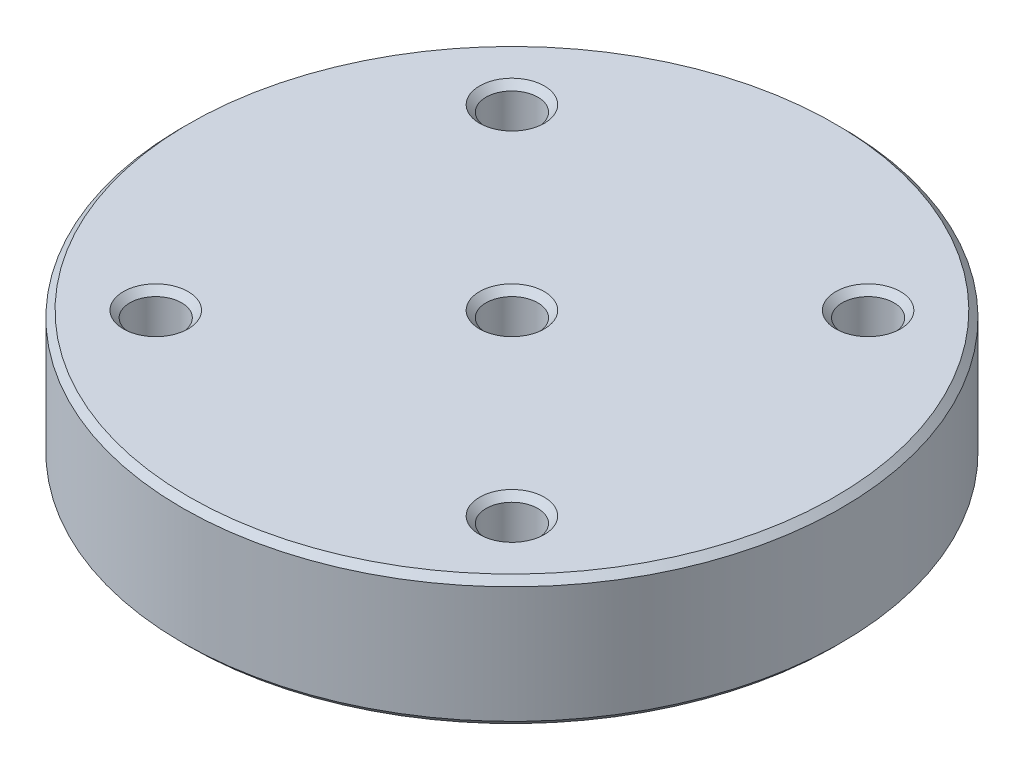
ISO-10303-21;
HEADER;
FILE_DESCRIPTION(('STEP AP214'),'2;1');
FILE_NAME('part.step','',(''),(''),'','','');
FILE_SCHEMA(('AUTOMOTIVE_DESIGN { 1 0 10303 214 1 1 1 1 }'));
ENDSEC;
DATA;
#1=APPLICATION_CONTEXT('core data for automotive mechanical design processes');
#2=APPLICATION_PROTOCOL_DEFINITION('international standard','automotive_design',2000,#1);
#3=PRODUCT_CONTEXT('',#1,'mechanical');
#4=PRODUCT('Part','Part','',(#3));
#5=PRODUCT_RELATED_PRODUCT_CATEGORY('part','',(#4));
#6=PRODUCT_DEFINITION_FORMATION('','',#4);
#7=PRODUCT_DEFINITION_CONTEXT('part definition',#1,'design');
#8=PRODUCT_DEFINITION('design','',#6,#7);
#9=PRODUCT_DEFINITION_SHAPE('','',#8);
#10=(LENGTH_UNIT() NAMED_UNIT(*) SI_UNIT(.MILLI.,.METRE.));
#11=(NAMED_UNIT(*) PLANE_ANGLE_UNIT() SI_UNIT($,.RADIAN.));
#12=(NAMED_UNIT(*) SI_UNIT($,.STERADIAN.) SOLID_ANGLE_UNIT());
#13=UNCERTAINTY_MEASURE_WITH_UNIT(LENGTH_MEASURE(1.E-05),#10,'distance_accuracy_value','');
#14=(GEOMETRIC_REPRESENTATION_CONTEXT(3) GLOBAL_UNCERTAINTY_ASSIGNED_CONTEXT((#13)) GLOBAL_UNIT_ASSIGNED_CONTEXT((#10,
#11,#12)) REPRESENTATION_CONTEXT('',''));
#15=CARTESIAN_POINT('',(0.,0.,0.));
#16=DIRECTION('',(0.,0.,1.));
#17=DIRECTION('',(1.,0.,0.));
#18=AXIS2_PLACEMENT_3D('',#15,#16,#17);
#19=CARTESIAN_POINT('',(0.,8.,0.));
#20=DIRECTION('',(0.,1.,0.));
#21=DIRECTION('',(0.,0.,1.));
#22=AXIS2_PLACEMENT_3D('',#19,#20,#21);
#23=PLANE('',#22);
#24=CARTESIAN_POINT('',(-11.,8.,11.));
#25=DIRECTION('',(0.,1.,0.));
#26=DIRECTION('',(0.,0.,1.));
#27=AXIS2_PLACEMENT_3D('',#24,#25,#26);
#28=CIRCLE('',#27,1.99999999999999);
#29=CARTESIAN_POINT('',(-11.,8.,13.));
#30=VERTEX_POINT('',#29);
#31=EDGE_CURVE('E10',#30,#30,#28,.F.);
#32=ORIENTED_EDGE('',*,*,#31,.T.);
#33=EDGE_LOOP('',(#32));
#34=FACE_BOUND('',#33,.T.);
#35=CARTESIAN_POINT('',(11.,8.,-11.));
#36=DIRECTION('',(0.,1.,0.));
#37=DIRECTION('',(0.,0.,1.));
#38=AXIS2_PLACEMENT_3D('',#35,#36,#37);
#39=CIRCLE('',#38,1.99999999999999);
#40=CARTESIAN_POINT('',(11.,8.,-9.00000000000001));
#41=VERTEX_POINT('',#40);
#42=EDGE_CURVE('E56',#41,#41,#39,.F.);
#43=ORIENTED_EDGE('',*,*,#42,.T.);
#44=EDGE_LOOP('',(#43));
#45=FACE_BOUND('',#44,.T.);
#46=CARTESIAN_POINT('',(0.,8.,0.));
#47=DIRECTION('',(0.,1.,0.));
#48=DIRECTION('',(0.,0.,1.));
#49=AXIS2_PLACEMENT_3D('',#46,#47,#48);
#50=CIRCLE('',#49,1.99999999999999);
#51=CARTESIAN_POINT('',(0.,8.,1.99999999999999));
#52=VERTEX_POINT('',#51);
#53=EDGE_CURVE('E61',#52,#52,#50,.F.);
#54=ORIENTED_EDGE('',*,*,#53,.T.);
#55=EDGE_LOOP('',(#54));
#56=FACE_BOUND('',#55,.T.);
#57=CARTESIAN_POINT('',(0.,8.,0.));
#58=DIRECTION('',(0.,1.,0.));
#59=DIRECTION('',(0.,0.,1.));
#60=AXIS2_PLACEMENT_3D('',#57,#58,#59);
#61=CIRCLE('',#60,19.9563491861041);
#62=CARTESIAN_POINT('',(0.,8.,19.9563491861041));
#63=VERTEX_POINT('',#62);
#64=EDGE_CURVE('E66',#63,#63,#61,.T.);
#65=ORIENTED_EDGE('',*,*,#64,.T.);
#66=EDGE_LOOP('',(#65));
#67=FACE_BOUND('',#66,.T.);
#68=CARTESIAN_POINT('',(-11.,8.,-11.));
#69=DIRECTION('',(0.,1.,0.));
#70=DIRECTION('',(0.,0.,1.));
#71=AXIS2_PLACEMENT_3D('',#68,#69,#70);
#72=CIRCLE('',#71,2.);
#73=CARTESIAN_POINT('',(-11.,8.,-9.));
#74=VERTEX_POINT('',#73);
#75=EDGE_CURVE('E72',#74,#74,#72,.F.);
#76=ORIENTED_EDGE('',*,*,#75,.T.);
#77=EDGE_LOOP('',(#76));
#78=FACE_BOUND('',#77,.T.);
#79=CARTESIAN_POINT('',(11.,8.,11.));
#80=DIRECTION('',(0.,1.,0.));
#81=DIRECTION('',(0.,0.,1.));
#82=AXIS2_PLACEMENT_3D('',#79,#80,#81);
#83=CIRCLE('',#82,1.99999999999999);
#84=CARTESIAN_POINT('',(11.,8.,13.));
#85=VERTEX_POINT('',#84);
#86=EDGE_CURVE('E76',#85,#85,#83,.F.);
#87=ORIENTED_EDGE('',*,*,#86,.T.);
#88=EDGE_LOOP('',(#87));
#89=FACE_BOUND('',#88,.T.);
#90=ADVANCED_FACE('F47',(#34,#45,#56,#67,#78,#89),#23,.T.);
#91=CARTESIAN_POINT('',(0.,0.,0.));
#92=DIRECTION('',(0.,1.,0.));
#93=DIRECTION('',(0.,0.,1.));
#94=AXIS2_PLACEMENT_3D('',#91,#92,#93);
#95=PLANE('',#94);
#96=CARTESIAN_POINT('',(-11.,0.,11.));
#97=DIRECTION('',(0.,1.,0.));
#98=DIRECTION('',(0.,0.,1.));
#99=AXIS2_PLACEMENT_3D('',#96,#97,#98);
#100=CIRCLE('',#99,1.99999999999999);
#101=CARTESIAN_POINT('',(-11.,0.,13.));
#102=VERTEX_POINT('',#101);
#103=EDGE_CURVE('E128',#102,#102,#100,.T.);
#104=ORIENTED_EDGE('',*,*,#103,.T.);
#105=EDGE_LOOP('',(#104));
#106=FACE_BOUND('',#105,.T.);
#107=CARTESIAN_POINT('',(11.,0.,11.));
#108=DIRECTION('',(0.,1.,0.));
#109=DIRECTION('',(0.,0.,1.));
#110=AXIS2_PLACEMENT_3D('',#107,#108,#109);
#111=CIRCLE('',#110,2.);
#112=CARTESIAN_POINT('',(11.,0.,13.));
#113=VERTEX_POINT('',#112);
#114=EDGE_CURVE('E132',#113,#113,#111,.T.);
#115=ORIENTED_EDGE('',*,*,#114,.T.);
#116=EDGE_LOOP('',(#115));
#117=FACE_BOUND('',#116,.T.);
#118=CARTESIAN_POINT('',(11.,0.,-11.));
#119=DIRECTION('',(0.,1.,0.));
#120=DIRECTION('',(0.,0.,1.));
#121=AXIS2_PLACEMENT_3D('',#118,#119,#120);
#122=CIRCLE('',#121,2.);
#123=CARTESIAN_POINT('',(11.,0.,-9.));
#124=VERTEX_POINT('',#123);
#125=EDGE_CURVE('E136',#124,#124,#122,.T.);
#126=ORIENTED_EDGE('',*,*,#125,.T.);
#127=EDGE_LOOP('',(#126));
#128=FACE_BOUND('',#127,.T.);
#129=CARTESIAN_POINT('',(-11.,0.,-11.));
#130=DIRECTION('',(0.,1.,0.));
#131=DIRECTION('',(0.,0.,1.));
#132=AXIS2_PLACEMENT_3D('',#129,#130,#131);
#133=CIRCLE('',#132,2.);
#134=CARTESIAN_POINT('',(-11.,0.,-9.));
#135=VERTEX_POINT('',#134);
#136=EDGE_CURVE('E140',#135,#135,#133,.T.);
#137=ORIENTED_EDGE('',*,*,#136,.T.);
#138=EDGE_LOOP('',(#137));
#139=FACE_BOUND('',#138,.T.);
#140=CARTESIAN_POINT('',(0.,0.,0.));
#141=DIRECTION('',(0.,1.,0.));
#142=DIRECTION('',(0.,0.,1.));
#143=AXIS2_PLACEMENT_3D('',#140,#141,#142);
#144=CIRCLE('',#143,1.99999999999999);
#145=CARTESIAN_POINT('',(0.,0.,1.99999999999999));
#146=VERTEX_POINT('',#145);
#147=EDGE_CURVE('E144',#146,#146,#144,.T.);
#148=ORIENTED_EDGE('',*,*,#147,.T.);
#149=EDGE_LOOP('',(#148));
#150=FACE_BOUND('',#149,.T.);
#151=CARTESIAN_POINT('',(0.,0.,0.));
#152=DIRECTION('',(0.,1.,0.));
#153=DIRECTION('',(0.,0.,1.));
#154=AXIS2_PLACEMENT_3D('',#151,#152,#153);
#155=CIRCLE('',#154,19.956349186104);
#156=CARTESIAN_POINT('',(0.,0.,19.956349186104));
#157=VERTEX_POINT('',#156);
#158=EDGE_CURVE('E148',#157,#157,#155,.F.);
#159=ORIENTED_EDGE('',*,*,#158,.T.);
#160=EDGE_LOOP('',(#159));
#161=FACE_BOUND('',#160,.T.);
#162=ADVANCED_FACE('F153',(#106,#117,#128,#139,#150,#161),#95,.F.);
#163=CARTESIAN_POINT('',(0.,8.,0.));
#164=DIRECTION('',(0.,-1.,0.));
#165=DIRECTION('',(0.,0.,-1.));
#166=AXIS2_PLACEMENT_3D('',#163,#164,#165);
#167=CYLINDRICAL_SURFACE('',#166,20.356349186104);
#168=CARTESIAN_POINT('',(0.,0.399999999999991,0.));
#169=DIRECTION('',(0.,1.,0.));
#170=DIRECTION('',(0.,0.,1.));
#171=AXIS2_PLACEMENT_3D('',#168,#169,#170);
#172=CIRCLE('',#171,20.356349186104);
#173=CARTESIAN_POINT('',(0.,0.399999999999991,20.356349186104));
#174=VERTEX_POINT('',#173);
#175=EDGE_CURVE('E80',#174,#174,#172,.T.);
#176=ORIENTED_EDGE('',*,*,#175,.T.);
#177=EDGE_LOOP('',(#176));
#178=FACE_BOUND('',#177,.T.);
#179=CARTESIAN_POINT('',(0.,7.60000000000001,0.));
#180=DIRECTION('',(0.,1.,0.));
#181=DIRECTION('',(0.,0.,1.));
#182=AXIS2_PLACEMENT_3D('',#179,#180,#181);
#183=CIRCLE('',#182,20.356349186104);
#184=CARTESIAN_POINT('',(0.,7.60000000000001,20.356349186104));
#185=VERTEX_POINT('',#184);
#186=EDGE_CURVE('E84',#185,#185,#183,.F.);
#187=ORIENTED_EDGE('',*,*,#186,.T.);
#188=EDGE_LOOP('',(#187));
#189=FACE_BOUND('',#188,.T.);
#190=ADVANCED_FACE('F163',(#178,#189),#167,.T.);
#191=CARTESIAN_POINT('',(0.,8.,0.));
#192=DIRECTION('',(0.,-1.,0.));
#193=DIRECTION('',(0.,0.,-1.));
#194=AXIS2_PLACEMENT_3D('',#191,#192,#193);
#195=CYLINDRICAL_SURFACE('',#194,1.6);
#196=CARTESIAN_POINT('',(0.,0.399999999999997,0.));
#197=DIRECTION('',(0.,1.,0.));
#198=DIRECTION('',(0.,0.,1.));
#199=AXIS2_PLACEMENT_3D('',#196,#197,#198);
#200=CIRCLE('',#199,1.6);
#201=CARTESIAN_POINT('',(0.,0.399999999999997,1.6));
#202=VERTEX_POINT('',#201);
#203=EDGE_CURVE('E88',#202,#202,#200,.F.);
#204=ORIENTED_EDGE('',*,*,#203,.T.);
#205=EDGE_LOOP('',(#204));
#206=FACE_BOUND('',#205,.T.);
#207=CARTESIAN_POINT('',(0.,7.6,0.));
#208=DIRECTION('',(0.,1.,0.));
#209=DIRECTION('',(0.,0.,1.));
#210=AXIS2_PLACEMENT_3D('',#207,#208,#209);
#211=CIRCLE('',#210,1.6);
#212=CARTESIAN_POINT('',(0.,7.6,1.6));
#213=VERTEX_POINT('',#212);
#214=EDGE_CURVE('E92',#213,#213,#211,.T.);
#215=ORIENTED_EDGE('',*,*,#214,.T.);
#216=EDGE_LOOP('',(#215));
#217=FACE_BOUND('',#216,.T.);
#218=ADVANCED_FACE('F166',(#206,#217),#195,.F.);
#219=CARTESIAN_POINT('',(-11.,8.,-11.));
#220=DIRECTION('',(0.,-1.,0.));
#221=DIRECTION('',(0.,0.,-1.));
#222=AXIS2_PLACEMENT_3D('',#219,#220,#221);
#223=CYLINDRICAL_SURFACE('',#222,1.6);
#224=CARTESIAN_POINT('',(-11.,0.399999999999998,-11.));
#225=DIRECTION('',(0.,1.,0.));
#226=DIRECTION('',(0.,0.,1.));
#227=AXIS2_PLACEMENT_3D('',#224,#225,#226);
#228=CIRCLE('',#227,1.6);
#229=CARTESIAN_POINT('',(-11.,0.399999999999998,-9.4));
#230=VERTEX_POINT('',#229);
#231=EDGE_CURVE('E96',#230,#230,#228,.F.);
#232=ORIENTED_EDGE('',*,*,#231,.T.);
#233=EDGE_LOOP('',(#232));
#234=FACE_BOUND('',#233,.T.);
#235=CARTESIAN_POINT('',(-11.,7.6,-11.));
#236=DIRECTION('',(0.,1.,0.));
#237=DIRECTION('',(0.,0.,1.));
#238=AXIS2_PLACEMENT_3D('',#235,#236,#237);
#239=CIRCLE('',#238,1.6);
#240=CARTESIAN_POINT('',(-11.,7.6,-9.4));
#241=VERTEX_POINT('',#240);
#242=EDGE_CURVE('E100',#241,#241,#239,.T.);
#243=ORIENTED_EDGE('',*,*,#242,.T.);
#244=EDGE_LOOP('',(#243));
#245=FACE_BOUND('',#244,.T.);
#246=ADVANCED_FACE('F202',(#234,#245),#223,.F.);
#247=CARTESIAN_POINT('',(11.,8.,-11.));
#248=DIRECTION('',(0.,-1.,0.));
#249=DIRECTION('',(0.,0.,-1.));
#250=AXIS2_PLACEMENT_3D('',#247,#248,#249);
#251=CYLINDRICAL_SURFACE('',#250,1.6);
#252=CARTESIAN_POINT('',(11.,0.399999999999998,-11.));
#253=DIRECTION('',(0.,1.,0.));
#254=DIRECTION('',(0.,0.,1.));
#255=AXIS2_PLACEMENT_3D('',#252,#253,#254);
#256=CIRCLE('',#255,1.6);
#257=CARTESIAN_POINT('',(11.,0.399999999999998,-9.4));
#258=VERTEX_POINT('',#257);
#259=EDGE_CURVE('E104',#258,#258,#256,.F.);
#260=ORIENTED_EDGE('',*,*,#259,.T.);
#261=EDGE_LOOP('',(#260));
#262=FACE_BOUND('',#261,.T.);
#263=CARTESIAN_POINT('',(11.,7.60000000000001,-11.));
#264=DIRECTION('',(0.,1.,0.));
#265=DIRECTION('',(0.,0.,1.));
#266=AXIS2_PLACEMENT_3D('',#263,#264,#265);
#267=CIRCLE('',#266,1.6);
#268=CARTESIAN_POINT('',(11.,7.60000000000001,-9.4));
#269=VERTEX_POINT('',#268);
#270=EDGE_CURVE('E108',#269,#269,#267,.T.);
#271=ORIENTED_EDGE('',*,*,#270,.T.);
#272=EDGE_LOOP('',(#271));
#273=FACE_BOUND('',#272,.T.);
#274=ADVANCED_FACE('F192',(#262,#273),#251,.F.);
#275=CARTESIAN_POINT('',(11.,8.,11.));
#276=DIRECTION('',(0.,-1.,0.));
#277=DIRECTION('',(0.,0.,-1.));
#278=AXIS2_PLACEMENT_3D('',#275,#276,#277);
#279=CYLINDRICAL_SURFACE('',#278,1.6);
#280=CARTESIAN_POINT('',(11.,0.399999999999998,11.));
#281=DIRECTION('',(0.,1.,0.));
#282=DIRECTION('',(0.,0.,1.));
#283=AXIS2_PLACEMENT_3D('',#280,#281,#282);
#284=CIRCLE('',#283,1.6);
#285=CARTESIAN_POINT('',(11.,0.399999999999998,12.6));
#286=VERTEX_POINT('',#285);
#287=EDGE_CURVE('E112',#286,#286,#284,.F.);
#288=ORIENTED_EDGE('',*,*,#287,.T.);
#289=EDGE_LOOP('',(#288));
#290=FACE_BOUND('',#289,.T.);
#291=CARTESIAN_POINT('',(11.,7.60000000000001,11.));
#292=DIRECTION('',(0.,1.,0.));
#293=DIRECTION('',(0.,0.,1.));
#294=AXIS2_PLACEMENT_3D('',#291,#292,#293);
#295=CIRCLE('',#294,1.6);
#296=CARTESIAN_POINT('',(11.,7.60000000000001,12.6));
#297=VERTEX_POINT('',#296);
#298=EDGE_CURVE('E116',#297,#297,#295,.T.);
#299=ORIENTED_EDGE('',*,*,#298,.T.);
#300=EDGE_LOOP('',(#299));
#301=FACE_BOUND('',#300,.T.);
#302=ADVANCED_FACE('F189',(#290,#301),#279,.F.);
#303=CARTESIAN_POINT('',(-11.,8.,11.));
#304=DIRECTION('',(0.,-1.,0.));
#305=DIRECTION('',(0.,0.,-1.));
#306=AXIS2_PLACEMENT_3D('',#303,#304,#305);
#307=CYLINDRICAL_SURFACE('',#306,1.6);
#308=CARTESIAN_POINT('',(-11.,0.399999999999992,11.));
#309=DIRECTION('',(0.,1.,0.));
#310=DIRECTION('',(0.,0.,1.));
#311=AXIS2_PLACEMENT_3D('',#308,#309,#310);
#312=CIRCLE('',#311,1.6);
#313=CARTESIAN_POINT('',(-11.,0.399999999999992,12.6));
#314=VERTEX_POINT('',#313);
#315=EDGE_CURVE('E120',#314,#314,#312,.F.);
#316=ORIENTED_EDGE('',*,*,#315,.T.);
#317=EDGE_LOOP('',(#316));
#318=FACE_BOUND('',#317,.T.);
#319=CARTESIAN_POINT('',(-11.,7.60000000000001,11.));
#320=DIRECTION('',(0.,1.,0.));
#321=DIRECTION('',(0.,0.,1.));
#322=AXIS2_PLACEMENT_3D('',#319,#320,#321);
#323=CIRCLE('',#322,1.6);
#324=CARTESIAN_POINT('',(-11.,7.60000000000001,12.6));
#325=VERTEX_POINT('',#324);
#326=EDGE_CURVE('E124',#325,#325,#323,.T.);
#327=ORIENTED_EDGE('',*,*,#326,.T.);
#328=EDGE_LOOP('',(#327));
#329=FACE_BOUND('',#328,.T.);
#330=ADVANCED_FACE('F191',(#318,#329),#307,.F.);
#331=CARTESIAN_POINT('',(-11.,0.,11.));
#332=DIRECTION('',(0.,-1.,0.));
#333=DIRECTION('',(0.,0.,-1.));
#334=AXIS2_PLACEMENT_3D('',#331,#332,#333);
#335=CONICAL_SURFACE('',#334,1.99999999999999,0.785398163397442);
#336=ORIENTED_EDGE('',*,*,#315,.F.);
#337=EDGE_LOOP('',(#336));
#338=FACE_BOUND('',#337,.T.);
#339=ORIENTED_EDGE('',*,*,#103,.F.);
#340=EDGE_LOOP('',(#339));
#341=FACE_BOUND('',#340,.T.);
#342=ADVANCED_FACE('F199',(#338,#341),#335,.F.);
#343=CARTESIAN_POINT('',(11.,0.,11.));
#344=DIRECTION('',(0.,-1.,0.));
#345=DIRECTION('',(0.,0.,-1.));
#346=AXIS2_PLACEMENT_3D('',#343,#344,#345);
#347=CONICAL_SURFACE('',#346,2.,0.78539816339745);
#348=ORIENTED_EDGE('',*,*,#287,.F.);
#349=EDGE_LOOP('',(#348));
#350=FACE_BOUND('',#349,.T.);
#351=ORIENTED_EDGE('',*,*,#114,.F.);
#352=EDGE_LOOP('',(#351));
#353=FACE_BOUND('',#352,.T.);
#354=ADVANCED_FACE('F221',(#350,#353),#347,.F.);
#355=CARTESIAN_POINT('',(11.,0.,-11.));
#356=DIRECTION('',(0.,-1.,0.));
#357=DIRECTION('',(0.,0.,-1.));
#358=AXIS2_PLACEMENT_3D('',#355,#356,#357);
#359=CONICAL_SURFACE('',#358,2.,0.785398163397452);
#360=ORIENTED_EDGE('',*,*,#259,.F.);
#361=EDGE_LOOP('',(#360));
#362=FACE_BOUND('',#361,.T.);
#363=ORIENTED_EDGE('',*,*,#125,.F.);
#364=EDGE_LOOP('',(#363));
#365=FACE_BOUND('',#364,.T.);
#366=ADVANCED_FACE('F228',(#362,#365),#359,.F.);
#367=CARTESIAN_POINT('',(-11.,0.,-11.));
#368=DIRECTION('',(0.,-1.,0.));
#369=DIRECTION('',(0.,0.,-1.));
#370=AXIS2_PLACEMENT_3D('',#367,#368,#369);
#371=CONICAL_SURFACE('',#370,2.,0.78539816339745);
#372=ORIENTED_EDGE('',*,*,#231,.F.);
#373=EDGE_LOOP('',(#372));
#374=FACE_BOUND('',#373,.T.);
#375=ORIENTED_EDGE('',*,*,#136,.F.);
#376=EDGE_LOOP('',(#375));
#377=FACE_BOUND('',#376,.T.);
#378=ADVANCED_FACE('F235',(#374,#377),#371,.F.);
#379=CARTESIAN_POINT('',(0.,0.,0.));
#380=DIRECTION('',(0.,-1.,0.));
#381=DIRECTION('',(0.,0.,-1.));
#382=AXIS2_PLACEMENT_3D('',#379,#380,#381);
#383=CONICAL_SURFACE('',#382,1.99999999999999,0.785398163397446);
#384=ORIENTED_EDGE('',*,*,#203,.F.);
#385=EDGE_LOOP('',(#384));
#386=FACE_BOUND('',#385,.T.);
#387=ORIENTED_EDGE('',*,*,#147,.F.);
#388=EDGE_LOOP('',(#387));
#389=FACE_BOUND('',#388,.T.);
#390=ADVANCED_FACE('F159',(#386,#389),#383,.F.);
#391=CARTESIAN_POINT('',(0.,0.399999999999991,0.));
#392=DIRECTION('',(0.,1.,0.));
#393=DIRECTION('',(0.,0.,1.));
#394=AXIS2_PLACEMENT_3D('',#391,#392,#393);
#395=CONICAL_SURFACE('',#394,20.356349186104,0.785398163397457);
#396=ORIENTED_EDGE('',*,*,#158,.F.);
#397=EDGE_LOOP('',(#396));
#398=FACE_BOUND('',#397,.T.);
#399=ORIENTED_EDGE('',*,*,#175,.F.);
#400=EDGE_LOOP('',(#399));
#401=FACE_BOUND('',#400,.T.);
#402=ADVANCED_FACE('F155',(#398,#401),#395,.T.);
#403=CARTESIAN_POINT('',(-11.,7.60000000000001,11.));
#404=DIRECTION('',(0.,1.,0.));
#405=DIRECTION('',(0.,0.,1.));
#406=AXIS2_PLACEMENT_3D('',#403,#404,#405);
#407=CONICAL_SURFACE('',#406,1.6,0.785398163397447);
#408=ORIENTED_EDGE('',*,*,#31,.F.);
#409=EDGE_LOOP('',(#408));
#410=FACE_BOUND('',#409,.T.);
#411=ORIENTED_EDGE('',*,*,#326,.F.);
#412=EDGE_LOOP('',(#411));
#413=FACE_BOUND('',#412,.T.);
#414=ADVANCED_FACE('F158',(#410,#413),#407,.F.);
#415=CARTESIAN_POINT('',(11.,7.60000000000001,-11.));
#416=DIRECTION('',(0.,1.,0.));
#417=DIRECTION('',(0.,0.,1.));
#418=AXIS2_PLACEMENT_3D('',#415,#416,#417);
#419=CONICAL_SURFACE('',#418,1.6,0.785398163397445);
#420=ORIENTED_EDGE('',*,*,#42,.F.);
#421=EDGE_LOOP('',(#420));
#422=FACE_BOUND('',#421,.T.);
#423=ORIENTED_EDGE('',*,*,#270,.F.);
#424=EDGE_LOOP('',(#423));
#425=FACE_BOUND('',#424,.T.);
#426=ADVANCED_FACE('F257',(#422,#425),#419,.F.);
#427=CARTESIAN_POINT('',(0.,7.6,0.));
#428=DIRECTION('',(0.,1.,0.));
#429=DIRECTION('',(0.,0.,1.));
#430=AXIS2_PLACEMENT_3D('',#427,#428,#429);
#431=CONICAL_SURFACE('',#430,1.6,0.785398163397447);
#432=ORIENTED_EDGE('',*,*,#53,.F.);
#433=EDGE_LOOP('',(#432));
#434=FACE_BOUND('',#433,.T.);
#435=ORIENTED_EDGE('',*,*,#214,.F.);
#436=EDGE_LOOP('',(#435));
#437=FACE_BOUND('',#436,.T.);
#438=ADVANCED_FACE('F174',(#434,#437),#431,.F.);
#439=CARTESIAN_POINT('',(0.,8.,0.));
#440=DIRECTION('',(0.,-1.,0.));
#441=DIRECTION('',(0.,0.,-1.));
#442=AXIS2_PLACEMENT_3D('',#439,#440,#441);
#443=CONICAL_SURFACE('',#442,19.9563491861041,0.785398163397453);
#444=ORIENTED_EDGE('',*,*,#186,.F.);
#445=EDGE_LOOP('',(#444));
#446=FACE_BOUND('',#445,.T.);
#447=ORIENTED_EDGE('',*,*,#64,.F.);
#448=EDGE_LOOP('',(#447));
#449=FACE_BOUND('',#448,.T.);
#450=ADVANCED_FACE('F170',(#446,#449),#443,.T.);
#451=CARTESIAN_POINT('',(-11.,7.6,-11.));
#452=DIRECTION('',(0.,1.,0.));
#453=DIRECTION('',(0.,0.,1.));
#454=AXIS2_PLACEMENT_3D('',#451,#452,#453);
#455=CONICAL_SURFACE('',#454,1.6,0.785398163397447);
#456=ORIENTED_EDGE('',*,*,#75,.F.);
#457=EDGE_LOOP('',(#456));
#458=FACE_BOUND('',#457,.T.);
#459=ORIENTED_EDGE('',*,*,#242,.F.);
#460=EDGE_LOOP('',(#459));
#461=FACE_BOUND('',#460,.T.);
#462=ADVANCED_FACE('F173',(#458,#461),#455,.F.);
#463=CARTESIAN_POINT('',(11.,7.60000000000001,11.));
#464=DIRECTION('',(0.,1.,0.));
#465=DIRECTION('',(0.,0.,1.));
#466=AXIS2_PLACEMENT_3D('',#463,#464,#465);
#467=CONICAL_SURFACE('',#466,1.6,0.785398163397447);
#468=ORIENTED_EDGE('',*,*,#86,.F.);
#469=EDGE_LOOP('',(#468));
#470=FACE_BOUND('',#469,.T.);
#471=ORIENTED_EDGE('',*,*,#298,.F.);
#472=EDGE_LOOP('',(#471));
#473=FACE_BOUND('',#472,.T.);
#474=ADVANCED_FACE('F50',(#470,#473),#467,.F.);
#475=CLOSED_SHELL('',(#90,#162,#190,#218,#246,#274,#302,#330,#342,#354,#366,#378,#390,#402,#414,
#426,#438,#450,#462,#474));
#476=MANIFOLD_SOLID_BREP('B2',#475);
#477=ADVANCED_BREP_SHAPE_REPRESENTATION('',(#18,#476),#14);
#478=SHAPE_DEFINITION_REPRESENTATION(#9,#477);
ENDSEC;
END-ISO-10303-21;
